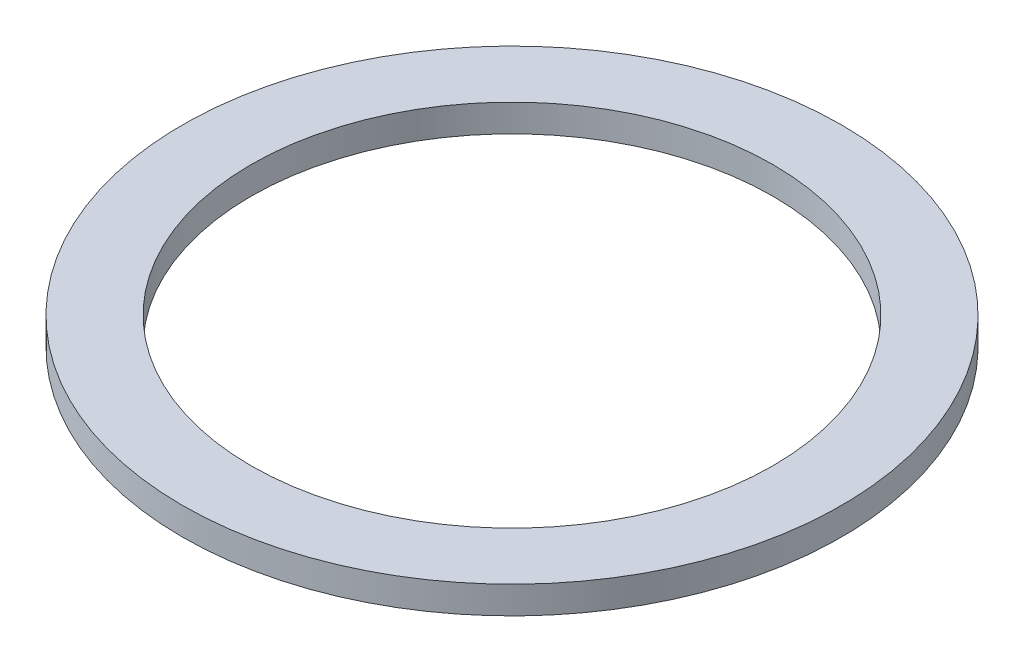
ISO-10303-21;
HEADER;
FILE_DESCRIPTION(('STEP AP214'),'2;1');
FILE_NAME('part.step','',(''),(''),'','','');
FILE_SCHEMA(('AUTOMOTIVE_DESIGN { 1 0 10303 214 1 1 1 1 }'));
ENDSEC;
DATA;
#1=APPLICATION_CONTEXT('core data for automotive mechanical design processes');
#2=APPLICATION_PROTOCOL_DEFINITION('international standard','automotive_design',2000,#1);
#3=PRODUCT_CONTEXT('',#1,'mechanical');
#4=PRODUCT('Part','Part','',(#3));
#5=PRODUCT_RELATED_PRODUCT_CATEGORY('part','',(#4));
#6=PRODUCT_DEFINITION_FORMATION('','',#4);
#7=PRODUCT_DEFINITION_CONTEXT('part definition',#1,'design');
#8=PRODUCT_DEFINITION('design','',#6,#7);
#9=PRODUCT_DEFINITION_SHAPE('','',#8);
#10=(LENGTH_UNIT() NAMED_UNIT(*) SI_UNIT(.MILLI.,.METRE.));
#11=(NAMED_UNIT(*) PLANE_ANGLE_UNIT() SI_UNIT($,.RADIAN.));
#12=(NAMED_UNIT(*) SI_UNIT($,.STERADIAN.) SOLID_ANGLE_UNIT());
#13=UNCERTAINTY_MEASURE_WITH_UNIT(LENGTH_MEASURE(1.E-05),#10,'distance_accuracy_value','');
#14=(GEOMETRIC_REPRESENTATION_CONTEXT(3) GLOBAL_UNCERTAINTY_ASSIGNED_CONTEXT((#13)) GLOBAL_UNIT_ASSIGNED_CONTEXT((#10,
#11,#12)) REPRESENTATION_CONTEXT('',''));
#15=CARTESIAN_POINT('',(0.,0.,0.));
#16=DIRECTION('',(0.,0.,1.));
#17=DIRECTION('',(1.,0.,0.));
#18=AXIS2_PLACEMENT_3D('',#15,#16,#17);
#19=CARTESIAN_POINT('',(0.,5.,0.));
#20=DIRECTION('',(0.,-1.,0.));
#21=DIRECTION('',(0.,0.,-1.));
#22=AXIS2_PLACEMENT_3D('',#19,#20,#21);
#23=CYLINDRICAL_SURFACE('',#22,60.);
#24=CARTESIAN_POINT('',(0.,5.,0.));
#25=DIRECTION('',(0.,1.,0.));
#26=DIRECTION('',(0.,0.,1.));
#27=AXIS2_PLACEMENT_3D('',#24,#25,#26);
#28=CIRCLE('',#27,60.);
#29=CARTESIAN_POINT('',(0.,5.,60.));
#30=VERTEX_POINT('',#29);
#31=EDGE_CURVE('E10',#30,#30,#28,.T.);
#32=ORIENTED_EDGE('',*,*,#31,.F.);
#33=EDGE_LOOP('',(#32));
#34=FACE_BOUND('',#33,.T.);
#35=CARTESIAN_POINT('',(0.,0.,0.));
#36=DIRECTION('',(0.,1.,0.));
#37=DIRECTION('',(0.,0.,1.));
#38=AXIS2_PLACEMENT_3D('',#35,#36,#37);
#39=CIRCLE('',#38,60.);
#40=CARTESIAN_POINT('',(0.,0.,60.));
#41=VERTEX_POINT('',#40);
#42=EDGE_CURVE('E37',#41,#41,#39,.T.);
#43=ORIENTED_EDGE('',*,*,#42,.T.);
#44=EDGE_LOOP('',(#43));
#45=FACE_BOUND('',#44,.T.);
#46=ADVANCED_FACE('F40',(#34,#45),#23,.T.);
#47=CARTESIAN_POINT('',(0.,5.,0.));
#48=DIRECTION('',(0.,1.,0.));
#49=DIRECTION('',(0.,0.,1.));
#50=AXIS2_PLACEMENT_3D('',#47,#48,#49);
#51=PLANE('',#50);
#52=CARTESIAN_POINT('',(0.,5.,0.));
#53=DIRECTION('',(0.,1.,0.));
#54=DIRECTION('',(0.,0.,1.));
#55=AXIS2_PLACEMENT_3D('',#52,#53,#54);
#56=CIRCLE('',#55,47.5);
#57=CARTESIAN_POINT('',(0.,5.,47.5));
#58=VERTEX_POINT('',#57);
#59=EDGE_CURVE('E50',#58,#58,#56,.T.);
#60=ORIENTED_EDGE('',*,*,#59,.F.);
#61=EDGE_LOOP('',(#60));
#62=FACE_BOUND('',#61,.T.);
#63=ORIENTED_EDGE('',*,*,#31,.T.);
#64=EDGE_LOOP('',(#63));
#65=FACE_BOUND('',#64,.T.);
#66=ADVANCED_FACE('F59',(#62,#65),#51,.T.);
#67=CARTESIAN_POINT('',(0.,0.,0.));
#68=DIRECTION('',(0.,1.,0.));
#69=DIRECTION('',(0.,0.,1.));
#70=AXIS2_PLACEMENT_3D('',#67,#68,#69);
#71=PLANE('',#70);
#72=CARTESIAN_POINT('',(0.,0.,0.));
#73=DIRECTION('',(0.,1.,0.));
#74=DIRECTION('',(0.,0.,1.));
#75=AXIS2_PLACEMENT_3D('',#72,#73,#74);
#76=CIRCLE('',#75,47.5);
#77=CARTESIAN_POINT('',(0.,0.,47.5));
#78=VERTEX_POINT('',#77);
#79=EDGE_CURVE('E47',#78,#78,#76,.T.);
#80=ORIENTED_EDGE('',*,*,#79,.T.);
#81=EDGE_LOOP('',(#80));
#82=FACE_BOUND('',#81,.T.);
#83=ORIENTED_EDGE('',*,*,#42,.F.);
#84=EDGE_LOOP('',(#83));
#85=FACE_BOUND('',#84,.T.);
#86=ADVANCED_FACE('F58',(#82,#85),#71,.F.);
#87=CARTESIAN_POINT('',(0.,5.,0.));
#88=DIRECTION('',(0.,-1.,0.));
#89=DIRECTION('',(0.,0.,-1.));
#90=AXIS2_PLACEMENT_3D('',#87,#88,#89);
#91=CYLINDRICAL_SURFACE('',#90,47.5);
#92=ORIENTED_EDGE('',*,*,#59,.T.);
#93=EDGE_LOOP('',(#92));
#94=FACE_BOUND('',#93,.T.);
#95=ORIENTED_EDGE('',*,*,#79,.F.);
#96=EDGE_LOOP('',(#95));
#97=FACE_BOUND('',#96,.T.);
#98=ADVANCED_FACE('F54',(#94,#97),#91,.F.);
#99=CLOSED_SHELL('',(#46,#66,#86,#98));
#100=MANIFOLD_SOLID_BREP('B2',#99);
#101=ADVANCED_BREP_SHAPE_REPRESENTATION('',(#18,#100),#14);
#102=SHAPE_DEFINITION_REPRESENTATION(#9,#101);
ENDSEC;
END-ISO-10303-21;
